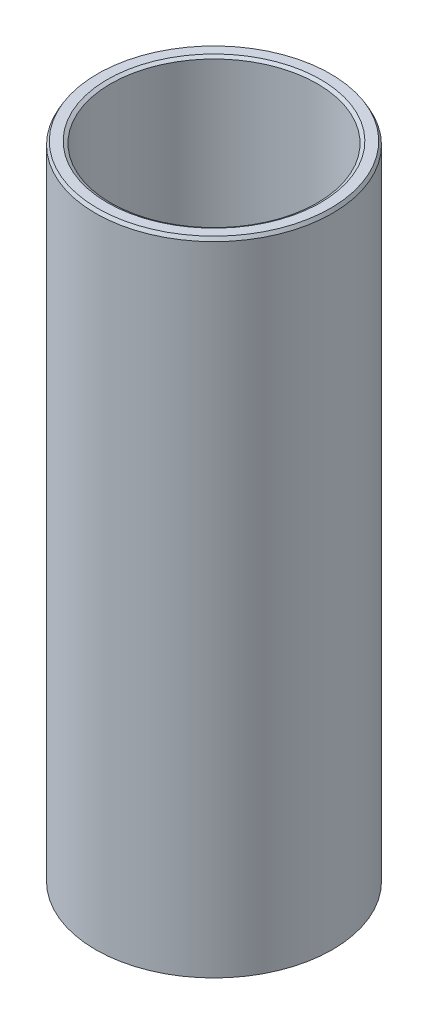
ISO-10303-21;
HEADER;
FILE_DESCRIPTION(('STEP AP214'),'2;1');
FILE_NAME('part.step','',(''),(''),'','','');
FILE_SCHEMA(('AUTOMOTIVE_DESIGN { 1 0 10303 214 1 1 1 1 }'));
ENDSEC;
DATA;
#1=APPLICATION_CONTEXT('core data for automotive mechanical design processes');
#2=APPLICATION_PROTOCOL_DEFINITION('international standard','automotive_design',2000,#1);
#3=PRODUCT_CONTEXT('',#1,'mechanical');
#4=PRODUCT('Part','Part','',(#3));
#5=PRODUCT_RELATED_PRODUCT_CATEGORY('part','',(#4));
#6=PRODUCT_DEFINITION_FORMATION('','',#4);
#7=PRODUCT_DEFINITION_CONTEXT('part definition',#1,'design');
#8=PRODUCT_DEFINITION('design','',#6,#7);
#9=PRODUCT_DEFINITION_SHAPE('','',#8);
#10=(LENGTH_UNIT() NAMED_UNIT(*) SI_UNIT(.MILLI.,.METRE.));
#11=(NAMED_UNIT(*) PLANE_ANGLE_UNIT() SI_UNIT($,.RADIAN.));
#12=(NAMED_UNIT(*) SI_UNIT($,.STERADIAN.) SOLID_ANGLE_UNIT());
#13=UNCERTAINTY_MEASURE_WITH_UNIT(LENGTH_MEASURE(1.E-05),#10,'distance_accuracy_value','');
#14=(GEOMETRIC_REPRESENTATION_CONTEXT(3) GLOBAL_UNCERTAINTY_ASSIGNED_CONTEXT((#13)) GLOBAL_UNIT_ASSIGNED_CONTEXT((#10,
#11,#12)) REPRESENTATION_CONTEXT('',''));
#15=CARTESIAN_POINT('',(0.,0.,0.));
#16=DIRECTION('',(0.,0.,1.));
#17=DIRECTION('',(1.,0.,0.));
#18=AXIS2_PLACEMENT_3D('',#15,#16,#17);
#19=CARTESIAN_POINT('',(0.,257.852960357064,0.));
#20=DIRECTION('',(0.,-1.,0.));
#21=DIRECTION('',(0.,0.,-1.));
#22=AXIS2_PLACEMENT_3D('',#19,#20,#21);
#23=CYLINDRICAL_SURFACE('',#22,47.5);
#24=CARTESIAN_POINT('',(0.,0.782675362975938,0.));
#25=DIRECTION('',(0.,1.,0.));
#26=DIRECTION('',(0.,0.,1.));
#27=AXIS2_PLACEMENT_3D('',#24,#25,#26);
#28=CIRCLE('',#27,47.5);
#29=CARTESIAN_POINT('',(0.,0.782675362975937,47.5));
#30=VERTEX_POINT('',#29);
#31=EDGE_CURVE('E10',#30,#30,#28,.T.);
#32=ORIENTED_EDGE('',*,*,#31,.T.);
#33=EDGE_LOOP('',(#32));
#34=FACE_BOUND('',#33,.T.);
#35=CARTESIAN_POINT('',(0.,256.497326862557,0.));
#36=DIRECTION('',(0.,1.,0.));
#37=DIRECTION('',(0.,0.,1.));
#38=AXIS2_PLACEMENT_3D('',#35,#36,#37);
#39=CIRCLE('',#38,47.5);
#40=CARTESIAN_POINT('',(0.,256.497326862557,47.5));
#41=VERTEX_POINT('',#40);
#42=EDGE_CURVE('E50',#41,#41,#39,.F.);
#43=ORIENTED_EDGE('',*,*,#42,.T.);
#44=EDGE_LOOP('',(#43));
#45=FACE_BOUND('',#44,.T.);
#46=ADVANCED_FACE('F39',(#34,#45),#23,.T.);
#47=CARTESIAN_POINT('',(0.,257.852960357064,0.));
#48=DIRECTION('',(0.,1.,0.));
#49=DIRECTION('',(0.,0.,1.));
#50=AXIS2_PLACEMENT_3D('',#47,#48,#49);
#51=PLANE('',#50);
#52=CARTESIAN_POINT('',(0.,257.852960357064,0.));
#53=DIRECTION('',(0.,1.,0.));
#54=DIRECTION('',(0.,0.,1.));
#55=AXIS2_PLACEMENT_3D('',#52,#53,#54);
#56=CIRCLE('',#55,42.7807289186375);
#57=CARTESIAN_POINT('',(0.,257.852960357064,42.7807289186375));
#58=VERTEX_POINT('',#57);
#59=EDGE_CURVE('E58',#58,#58,#56,.F.);
#60=ORIENTED_EDGE('',*,*,#59,.T.);
#61=EDGE_LOOP('',(#60));
#62=FACE_BOUND('',#61,.T.);
#63=CARTESIAN_POINT('',(0.,257.852960357064,0.));
#64=DIRECTION('',(0.,1.,0.));
#65=DIRECTION('',(0.,0.,1.));
#66=AXIS2_PLACEMENT_3D('',#63,#64,#65);
#67=CIRCLE('',#66,46.717324637024);
#68=CARTESIAN_POINT('',(0.,257.852960357064,46.717324637024));
#69=VERTEX_POINT('',#68);
#70=EDGE_CURVE('E61',#69,#69,#67,.T.);
#71=ORIENTED_EDGE('',*,*,#70,.T.);
#72=EDGE_LOOP('',(#71));
#73=FACE_BOUND('',#72,.T.);
#74=ADVANCED_FACE('F88',(#62,#73),#51,.T.);
#75=CARTESIAN_POINT('',(0.,0.,0.));
#76=DIRECTION('',(0.,1.,0.));
#77=DIRECTION('',(0.,0.,1.));
#78=AXIS2_PLACEMENT_3D('',#75,#76,#77);
#79=PLANE('',#78);
#80=CARTESIAN_POINT('',(0.,0.,0.));
#81=DIRECTION('',(0.,1.,0.));
#82=DIRECTION('',(0.,0.,1.));
#83=AXIS2_PLACEMENT_3D('',#80,#81,#82);
#84=CIRCLE('',#83,42.2077707871066);
#85=CARTESIAN_POINT('',(0.,0.,-42.2077707871066));
#86=VERTEX_POINT('',#85);
#87=EDGE_CURVE('E51',#86,#86,#84,.T.);
#88=ORIENTED_EDGE('',*,*,#87,.T.);
#89=EDGE_LOOP('',(#88));
#90=FACE_BOUND('',#89,.T.);
#91=CARTESIAN_POINT('',(0.,0.,0.));
#92=DIRECTION('',(0.,1.,0.));
#93=DIRECTION('',(0.,0.,1.));
#94=AXIS2_PLACEMENT_3D('',#91,#92,#93);
#95=CIRCLE('',#94,46.1443665054933);
#96=CARTESIAN_POINT('',(0.,0.,46.1443665054933));
#97=VERTEX_POINT('',#96);
#98=EDGE_CURVE('E54',#97,#97,#95,.F.);
#99=ORIENTED_EDGE('',*,*,#98,.T.);
#100=EDGE_LOOP('',(#99));
#101=FACE_BOUND('',#100,.T.);
#102=ADVANCED_FACE('F83',(#90,#101),#79,.F.);
#103=CARTESIAN_POINT('',(0.,257.852960357064,0.));
#104=DIRECTION('',(0.,-1.,0.));
#105=DIRECTION('',(0.,0.,-1.));
#106=AXIS2_PLACEMENT_3D('',#103,#104,#105);
#107=CYLINDRICAL_SURFACE('',#106,41.4250954241307);
#108=CARTESIAN_POINT('',(0.,257.070284994088,0.));
#109=DIRECTION('',(0.,1.,0.));
#110=DIRECTION('',(0.,0.,1.));
#111=AXIS2_PLACEMENT_3D('',#108,#109,#110);
#112=CIRCLE('',#111,41.4250954241307);
#113=CARTESIAN_POINT('',(0.,257.070284994088,41.4250954241307));
#114=VERTEX_POINT('',#113);
#115=EDGE_CURVE('E67',#114,#114,#112,.T.);
#116=ORIENTED_EDGE('',*,*,#115,.T.);
#117=EDGE_LOOP('',(#116));
#118=FACE_BOUND('',#117,.T.);
#119=CARTESIAN_POINT('',(0.,1.35563349450674,0.));
#120=DIRECTION('',(0.,1.,0.));
#121=DIRECTION('',(0.,0.,1.));
#122=AXIS2_PLACEMENT_3D('',#119,#120,#121);
#123=CIRCLE('',#122,41.4250954241307);
#124=CARTESIAN_POINT('',(0.,1.35563349450674,-41.4250954241307));
#125=VERTEX_POINT('',#124);
#126=EDGE_CURVE('E69',#125,#125,#123,.F.);
#127=ORIENTED_EDGE('',*,*,#126,.T.);
#128=EDGE_LOOP('',(#127));
#129=FACE_BOUND('',#128,.T.);
#130=ADVANCED_FACE('F71',(#118,#129),#107,.F.);
#131=CARTESIAN_POINT('',(0.,257.070284994088,0.));
#132=DIRECTION('',(0.,1.,0.));
#133=DIRECTION('',(0.,0.,1.));
#134=AXIS2_PLACEMENT_3D('',#131,#132,#133);
#135=CONICAL_SURFACE('',#134,41.4250954241307,1.04719755119659);
#136=ORIENTED_EDGE('',*,*,#59,.F.);
#137=EDGE_LOOP('',(#136));
#138=FACE_BOUND('',#137,.T.);
#139=ORIENTED_EDGE('',*,*,#115,.F.);
#140=EDGE_LOOP('',(#139));
#141=FACE_BOUND('',#140,.T.);
#142=ADVANCED_FACE('F77',(#138,#141),#135,.F.);
#143=CARTESIAN_POINT('',(0.,0.,0.));
#144=DIRECTION('',(0.,-1.,0.));
#145=DIRECTION('',(0.,0.,-1.));
#146=AXIS2_PLACEMENT_3D('',#143,#144,#145);
#147=CONICAL_SURFACE('',#146,42.2077707871066,0.523598775598299);
#148=CARTESIAN_POINT('',(0.,1.35563349450674,-41.4250954241307));
#149=CARTESIAN_POINT('',(0.,1.34151231227229,-41.433248292495));
#150=CARTESIAN_POINT('',(0.,1.32739113003784,-41.4414011608593));
#151=CARTESIAN_POINT('',(0.,1.29914876556895,-41.457706897588));
#152=CARTESIAN_POINT('',(0.,1.28502758333451,-41.4658597659523));
#153=CARTESIAN_POINT('',(0.,1.25678521886562,-41.482165502681));
#154=CARTESIAN_POINT('',(0.,1.24266403663117,-41.4903183710453));
#155=CARTESIAN_POINT('',(0.,1.21442167216228,-41.506624107774));
#156=CARTESIAN_POINT('',(0.,1.20030048992784,-41.5147769761384));
#157=CARTESIAN_POINT('',(0.,1.17205812545895,-41.531082712867));
#158=CARTESIAN_POINT('',(0.,1.1579369432245,-41.5392355812313));
#159=CARTESIAN_POINT('',(0.,1.12969457875561,-41.55554131796));
#160=CARTESIAN_POINT('',(0.,1.11557339652117,-41.5636941863243));
#161=CARTESIAN_POINT('',(0.,1.08733103205228,-41.579999923053));
#162=CARTESIAN_POINT('',(0.,1.07320984981783,-41.5881527914173));
#163=CARTESIAN_POINT('',(0.,1.04496748534894,-41.604458528146));
#164=CARTESIAN_POINT('',(0.,1.0308463031145,-41.6126113965103));
#165=CARTESIAN_POINT('',(0.,1.00260393864561,-41.628917133239));
#166=CARTESIAN_POINT('',(0.,0.988482756411161,-41.6370700016033));
#167=CARTESIAN_POINT('',(0.,0.960240391942271,-41.653375738332));
#168=CARTESIAN_POINT('',(0.,0.946119209707826,-41.6615286066963));
#169=CARTESIAN_POINT('',(0.,0.917876845238936,-41.677834343425));
#170=CARTESIAN_POINT('',(0.,0.903755663004491,-41.6859872117893));
#171=CARTESIAN_POINT('',(0.,0.875513298535601,-41.702292948518));
#172=CARTESIAN_POINT('',(0.,0.861392116301155,-41.7104458168823));
#173=CARTESIAN_POINT('',(0.,0.833149751832265,-41.726751553611));
#174=CARTESIAN_POINT('',(0.,0.819028569597819,-41.7349044219753));
#175=CARTESIAN_POINT('',(0.,0.790786205128929,-41.751210158704));
#176=CARTESIAN_POINT('',(0.,0.776665022894484,-41.7593630270683));
#177=CARTESIAN_POINT('',(0.,0.748422658425594,-41.775668763797));
#178=CARTESIAN_POINT('',(0.,0.734301476191149,-41.7838216321613));
#179=CARTESIAN_POINT('',(0.,0.706059111722259,-41.80012736889));
#180=CARTESIAN_POINT('',(0.,0.691937929487813,-41.8082802372543));
#181=CARTESIAN_POINT('',(0.,0.663695565018923,-41.824585973983));
#182=CARTESIAN_POINT('',(0.,0.649574382784477,-41.8327388423473));
#183=CARTESIAN_POINT('',(0.,0.621332018315587,-41.849044579076));
#184=CARTESIAN_POINT('',(0.,0.607210836081142,-41.8571974474403));
#185=CARTESIAN_POINT('',(0.,0.578968471612252,-41.873503184169));
#186=CARTESIAN_POINT('',(0.,0.564847289377807,-41.8816560525333));
#187=CARTESIAN_POINT('',(0.,0.536604924908917,-41.897961789262));
#188=CARTESIAN_POINT('',(0.,0.522483742674471,-41.9061146576263));
#189=CARTESIAN_POINT('',(0.,0.494241378205581,-41.922420394355));
#190=CARTESIAN_POINT('',(0.,0.480120195971135,-41.9305732627193));
#191=CARTESIAN_POINT('',(0.,0.451877831502245,-41.946878999448));
#192=CARTESIAN_POINT('',(0.,0.4377566492678,-41.9550318678123));
#193=CARTESIAN_POINT('',(0.,0.40951428479891,-41.971337604541));
#194=CARTESIAN_POINT('',(0.,0.395393102564465,-41.9794904729053));
#195=CARTESIAN_POINT('',(0.,0.367150738095575,-41.995796209634));
#196=CARTESIAN_POINT('',(0.,0.353029555861129,-42.0039490779983));
#197=CARTESIAN_POINT('',(0.,0.324787191392239,-42.020254814727));
#198=CARTESIAN_POINT('',(0.,0.310666009157793,-42.0284076830913));
#199=CARTESIAN_POINT('',(0.,0.282423644688903,-42.04471341982));
#200=CARTESIAN_POINT('',(0.,0.268302462454458,-42.0528662881843));
#201=CARTESIAN_POINT('',(0.,0.240060097985568,-42.069172024913));
#202=CARTESIAN_POINT('',(0.,0.225938915751123,-42.0773248932773));
#203=CARTESIAN_POINT('',(0.,0.197696551282233,-42.093630630006));
#204=CARTESIAN_POINT('',(0.,0.183575369047787,-42.1017834983703));
#205=CARTESIAN_POINT('',(0.,0.155333004578897,-42.118089235099));
#206=CARTESIAN_POINT('',(0.,0.141211822344451,-42.1262421034633));
#207=CARTESIAN_POINT('',(0.,0.112969457875561,-42.142547840192));
#208=CARTESIAN_POINT('',(0.,0.0988482756411159,-42.1507007085563));
#209=CARTESIAN_POINT('',(0.,0.070605911172226,-42.167006445285));
#210=CARTESIAN_POINT('',(0.,0.056484728937781,-42.1751593136493));
#211=CARTESIAN_POINT('',(0.,0.028242364468891,-42.191465050378));
#212=CARTESIAN_POINT('',(0.,0.014121182234446,-42.1996179187423));
#213=CARTESIAN_POINT('',(0.,0.,-42.2077707871066));
#214=B_SPLINE_CURVE_WITH_KNOTS('',3,(#148,#149,#150,#151,#152,#153,#154,#155,#156,#157,#158,
#159,#160,#161,#162,#163,#164,#165,#166,#167,#168,#169,#170,#171,#172,#173,#174,#175,#176,#177,
#178,#179,#180,#181,#182,#183,#184,#185,#186,#187,#188,#189,#190,#191,#192,#193,#194,#195,#196,
#197,#198,#199,#200,#201,#202,#203,#204,#205,#206,#207,#208,#209,#210,#211,#212,#213),
.UNSPECIFIED.,.F.,.F.,(4,2,2,2,2,2,2,2,2,2,2,2,2,2,2,2,2,2,2,2,2,2,2,2,2,2,2,2,2,2,2,2,4),(0.,
0.0489172101859943,0.0978344203719922,0.14675163055799,0.195668840743984,0.244586050929979,
0.293503261115976,0.342420471301974,0.391337681487969,0.440254891673963,0.489172101859961,
0.538089312045959,0.587006522231953,0.635923732417947,0.684840942603945,0.733758152789943,
0.782675362975937,0.831592573161932,0.88050978334793,0.929426993533927,0.978344203719922,
1.02726141390592,1.07617862409191,1.12509583427791,1.17401304446391,1.2229302546499,
1.2718474648359,1.3207646750219,1.36968188520789,1.41859909539388,1.46751630557988,
1.51643351576588,1.56535072595187),.UNSPECIFIED.);
#215=EDGE_CURVE('BSEAM73',#125,#86,#214,.T.);
#216=ORIENTED_EDGE('',*,*,#126,.F.);
#217=ORIENTED_EDGE('',*,*,#87,.F.);
#218=ORIENTED_EDGE('',*,*,#215,.T.);
#219=ORIENTED_EDGE('',*,*,#215,.F.);
#220=EDGE_LOOP('',(#216,#218,#217,#219));
#221=FACE_BOUND('',#220,.T.);
#222=ADVANCED_FACE('F73',(#221),#147,.F.);
#223=CARTESIAN_POINT('',(0.,0.782675362975938,0.));
#224=DIRECTION('',(0.,1.,0.));
#225=DIRECTION('',(0.,0.,1.));
#226=AXIS2_PLACEMENT_3D('',#223,#224,#225);
#227=CONICAL_SURFACE('',#226,47.5,1.0471975511966);
#228=CARTESIAN_POINT('',(0.,0.,46.1443665054933));
#229=CARTESIAN_POINT('',(0.,0.00815286836433093,46.1584876877277));
#230=CARTESIAN_POINT('',(0.,0.0163057367286642,46.1726088699621));
#231=CARTESIAN_POINT('',(0.,0.0326114734573307,46.200851234431));
#232=CARTESIAN_POINT('',(0.,0.0407643418216639,46.2149724166655));
#233=CARTESIAN_POINT('',(0.,0.057070078550329,46.2432147811344));
#234=CARTESIAN_POINT('',(0.,0.0652229469146609,46.2573359633688));
#235=CARTESIAN_POINT('',(0.,0.0815286836433262,46.2855783278377));
#236=CARTESIAN_POINT('',(0.,0.0896815520076597,46.2996995100722));
#237=CARTESIAN_POINT('',(0.,0.105987288736325,46.327941874541));
#238=CARTESIAN_POINT('',(0.,0.114140157100658,46.3420630567755));
#239=CARTESIAN_POINT('',(0.,0.130445893829322,46.3703054212444));
#240=CARTESIAN_POINT('',(0.,0.138598762193655,46.3844266034788));
#241=CARTESIAN_POINT('',(0.,0.154904498922321,46.4126689679477));
#242=CARTESIAN_POINT('',(0.,0.163057367286654,46.4267901501822));
#243=CARTESIAN_POINT('',(0.,0.179363104015319,46.4550325146511));
#244=CARTESIAN_POINT('',(0.,0.187515972379651,46.4691536968855));
#245=CARTESIAN_POINT('',(0.,0.203821709108316,46.4973960613544));
#246=CARTESIAN_POINT('',(0.,0.21197457747265,46.5115172435888));
#247=CARTESIAN_POINT('',(0.,0.228280314201316,46.5397596080577));
#248=CARTESIAN_POINT('',(0.,0.236433182565647,46.5538807902922));
#249=CARTESIAN_POINT('',(0.,0.252738919294313,46.5821231547611));
#250=CARTESIAN_POINT('',(0.,0.260891787658646,46.5962443369955));
#251=CARTESIAN_POINT('',(0.,0.277197524387312,46.6244867014644));
#252=CARTESIAN_POINT('',(0.,0.285350392751644,46.6386078836988));
#253=CARTESIAN_POINT('',(0.,0.301656129480309,46.6668502481677));
#254=CARTESIAN_POINT('',(0.,0.309808997844641,46.6809714304022));
#255=CARTESIAN_POINT('',(0.,0.326114734573307,46.7092137948711));
#256=CARTESIAN_POINT('',(0.,0.33426760293764,46.7233349771055));
#257=CARTESIAN_POINT('',(0.,0.350573339666306,46.7515773415744));
#258=CARTESIAN_POINT('',(0.,0.358726208030637,46.7656985238088));
#259=CARTESIAN_POINT('',(0.,0.375031944759303,46.7939408882777));
#260=CARTESIAN_POINT('',(0.,0.383184813123636,46.8080620705122));
#261=CARTESIAN_POINT('',(0.,0.399490549852302,46.8363044349811));
#262=CARTESIAN_POINT('',(0.,0.407643418216634,46.8504256172155));
#263=CARTESIAN_POINT('',(0.,0.423949154945299,46.8786679816844));
#264=CARTESIAN_POINT('',(0.,0.432102023309631,46.8927891639189));
#265=CARTESIAN_POINT('',(0.,0.448407760038297,46.9210315283877));
#266=CARTESIAN_POINT('',(0.,0.456560628402631,46.9351527106222));
#267=CARTESIAN_POINT('',(0.,0.472866365131296,46.9633950750911));
#268=CARTESIAN_POINT('',(0.,0.481019233495628,46.9775162573255));
#269=CARTESIAN_POINT('',(0.,0.497324970224293,47.0057586217944));
#270=CARTESIAN_POINT('',(0.,0.505477838588627,47.0198798040289));
#271=CARTESIAN_POINT('',(0.,0.521783575317292,47.0481221684978));
#272=CARTESIAN_POINT('',(0.,0.529936443681625,47.0622433507322));
#273=CARTESIAN_POINT('',(0.,0.546242180410289,47.0904857152011));
#274=CARTESIAN_POINT('',(0.,0.554395048774622,47.1046068974355));
#275=CARTESIAN_POINT('',(0.,0.570700785503287,47.1328492619044));
#276=CARTESIAN_POINT('',(0.,0.578853653867621,47.1469704441389));
#277=CARTESIAN_POINT('',(0.,0.595159390596286,47.1752128086078));
#278=CARTESIAN_POINT('',(0.,0.603312258960618,47.1893339908422));
#279=CARTESIAN_POINT('',(0.,0.619617995689283,47.2175763553111));
#280=CARTESIAN_POINT('',(0.,0.627770864053617,47.2316975375455));
#281=CARTESIAN_POINT('',(0.,0.644076600782283,47.2599399020144));
#282=CARTESIAN_POINT('',(0.,0.652229469146615,47.2740610842489));
#283=CARTESIAN_POINT('',(0.,0.66853520587528,47.3023034487178));
#284=CARTESIAN_POINT('',(0.,0.676688074239612,47.3164246309522));
#285=CARTESIAN_POINT('',(0.,0.692993810968278,47.3446669954211));
#286=CARTESIAN_POINT('',(0.,0.701146679332611,47.3587881776556));
#287=CARTESIAN_POINT('',(0.,0.717452416061276,47.3870305421244));
#288=CARTESIAN_POINT('',(0.,0.725605284425608,47.4011517243589));
#289=CARTESIAN_POINT('',(0.,0.741911021154273,47.4293940888278));
#290=CARTESIAN_POINT('',(0.,0.750063889518607,47.4435152710622));
#291=CARTESIAN_POINT('',(0.,0.766369626247273,47.4717576355311));
#292=CARTESIAN_POINT('',(0.,0.774522494611606,47.4858788177656));
#293=CARTESIAN_POINT('',(0.,0.782675362975937,47.5));
#294=B_SPLINE_CURVE_WITH_KNOTS('',3,(#228,#229,#230,#231,#232,#233,#234,#235,#236,#237,#238,
#239,#240,#241,#242,#243,#244,#245,#246,#247,#248,#249,#250,#251,#252,#253,#254,#255,#256,#257,
#258,#259,#260,#261,#262,#263,#264,#265,#266,#267,#268,#269,#270,#271,#272,#273,#274,#275,#276,
#277,#278,#279,#280,#281,#282,#283,#284,#285,#286,#287,#288,#289,#290,#291,#292,#293),
.UNSPECIFIED.,.F.,.F.,(4,2,2,2,2,2,2,2,2,2,2,2,2,2,2,2,2,2,2,2,2,2,2,2,2,2,2,2,2,2,2,2,4),(0.,
0.0489172101859991,0.0978344203719922,0.146751630557991,0.195668840743984,0.244586050929983,
0.293503261115982,0.342420471301976,0.391337681487975,0.440254891673968,0.489172101859967,
0.53808931204596,0.587006522231959,0.635923732417958,0.684840942603951,0.73375815278995,
0.782675362975943,0.831592573161943,0.880509783347942,0.929426993533935,0.978344203719934,
1.02726141390593,1.07617862409193,1.12509583427793,1.17401304446392,1.22293025464992,
1.27184746483591,1.32076467502191,1.36968188520791,1.4185990953939,1.4675163055799,
1.51643351576589,1.56535072595189),.UNSPECIFIED.);
#295=EDGE_CURVE('BSEAM76',#97,#30,#294,.T.);
#296=ORIENTED_EDGE('',*,*,#98,.F.);
#297=ORIENTED_EDGE('',*,*,#31,.F.);
#298=ORIENTED_EDGE('',*,*,#295,.T.);
#299=ORIENTED_EDGE('',*,*,#295,.F.);
#300=EDGE_LOOP('',(#296,#298,#297,#299));
#301=FACE_BOUND('',#300,.T.);
#302=ADVANCED_FACE('F76',(#301),#227,.T.);
#303=CARTESIAN_POINT('',(0.,257.852960357064,0.));
#304=DIRECTION('',(0.,-1.,0.));
#305=DIRECTION('',(0.,0.,-1.));
#306=AXIS2_PLACEMENT_3D('',#303,#304,#305);
#307=CONICAL_SURFACE('',#306,46.717324637024,0.523598775598303);
#308=ORIENTED_EDGE('',*,*,#42,.F.);
#309=EDGE_LOOP('',(#308));
#310=FACE_BOUND('',#309,.T.);
#311=ORIENTED_EDGE('',*,*,#70,.F.);
#312=EDGE_LOOP('',(#311));
#313=FACE_BOUND('',#312,.T.);
#314=ADVANCED_FACE('F45',(#310,#313),#307,.T.);
#315=CLOSED_SHELL('',(#46,#74,#102,#130,#142,#222,#302,#314));
#316=MANIFOLD_SOLID_BREP('B2',#315);
#317=ADVANCED_BREP_SHAPE_REPRESENTATION('',(#18,#316),#14);
#318=SHAPE_DEFINITION_REPRESENTATION(#9,#317);
ENDSEC;
END-ISO-10303-21;
